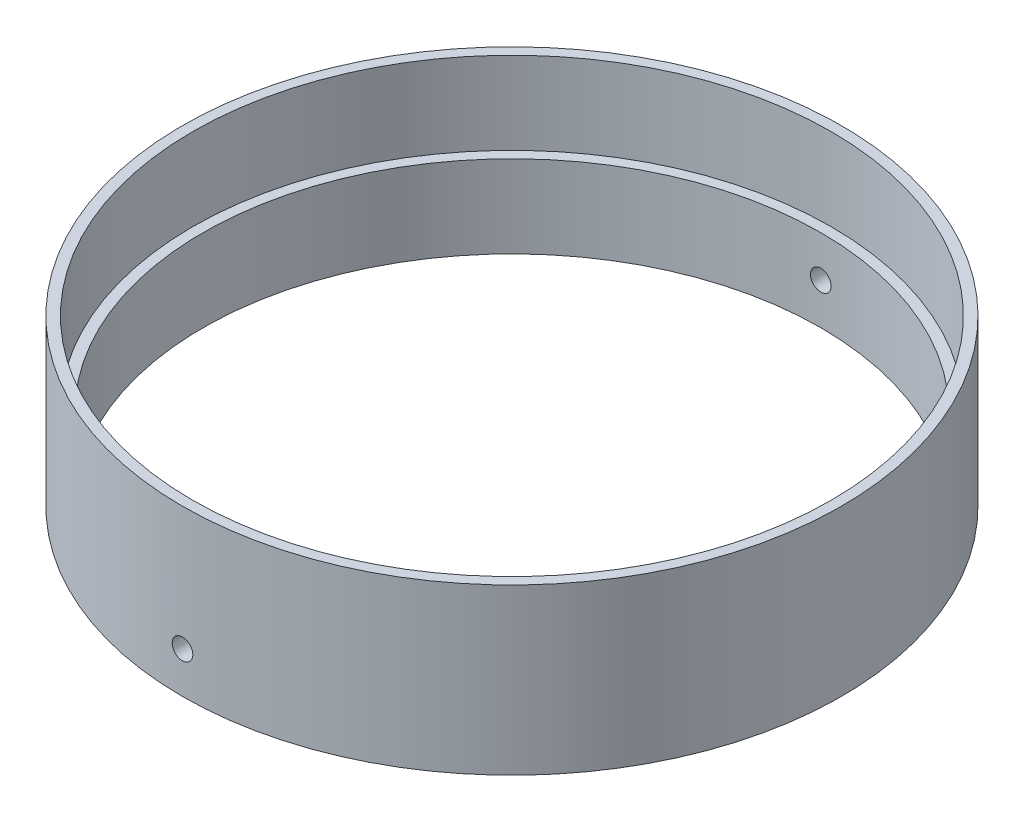
ISO-10303-21;
HEADER;
FILE_DESCRIPTION(('STEP AP214'),'2;1');
FILE_NAME('part.step','',(''),(''),'','','');
FILE_SCHEMA(('AUTOMOTIVE_DESIGN { 1 0 10303 214 1 1 1 1 }'));
ENDSEC;
DATA;
#1=APPLICATION_CONTEXT('core data for automotive mechanical design processes');
#2=APPLICATION_PROTOCOL_DEFINITION('international standard','automotive_design',2000,#1);
#3=PRODUCT_CONTEXT('',#1,'mechanical');
#4=PRODUCT('Part','Part','',(#3));
#5=PRODUCT_RELATED_PRODUCT_CATEGORY('part','',(#4));
#6=PRODUCT_DEFINITION_FORMATION('','',#4);
#7=PRODUCT_DEFINITION_CONTEXT('part definition',#1,'design');
#8=PRODUCT_DEFINITION('design','',#6,#7);
#9=PRODUCT_DEFINITION_SHAPE('','',#8);
#10=(LENGTH_UNIT() NAMED_UNIT(*) SI_UNIT(.MILLI.,.METRE.));
#11=(NAMED_UNIT(*) PLANE_ANGLE_UNIT() SI_UNIT($,.RADIAN.));
#12=(NAMED_UNIT(*) SI_UNIT($,.STERADIAN.) SOLID_ANGLE_UNIT());
#13=UNCERTAINTY_MEASURE_WITH_UNIT(LENGTH_MEASURE(1.E-05),#10,'distance_accuracy_value','');
#14=(GEOMETRIC_REPRESENTATION_CONTEXT(3) GLOBAL_UNCERTAINTY_ASSIGNED_CONTEXT((#13)) GLOBAL_UNIT_ASSIGNED_CONTEXT((#10,
#11,#12)) REPRESENTATION_CONTEXT('',''));
#15=CARTESIAN_POINT('',(0.,0.,0.));
#16=DIRECTION('',(0.,0.,1.));
#17=DIRECTION('',(1.,0.,0.));
#18=AXIS2_PLACEMENT_3D('',#15,#16,#17);
#19=CARTESIAN_POINT('',(0.,25.4,0.));
#20=DIRECTION('',(0.,-1.,0.));
#21=DIRECTION('',(0.,0.,-1.));
#22=AXIS2_PLACEMENT_3D('',#19,#20,#21);
#23=CYLINDRICAL_SURFACE('',#22,101.6);
#24=CARTESIAN_POINT('',(0.,0.,0.));
#25=DIRECTION('',(0.,1.,0.));
#26=DIRECTION('',(0.,0.,1.));
#27=AXIS2_PLACEMENT_3D('',#24,#25,#26);
#28=CIRCLE('',#27,101.6);
#29=CARTESIAN_POINT('',(0.,0.,101.6));
#30=VERTEX_POINT('',#29);
#31=EDGE_CURVE('E10',#30,#30,#28,.T.);
#32=ORIENTED_EDGE('',*,*,#31,.T.);
#33=EDGE_LOOP('',(#32));
#34=FACE_BOUND('',#33,.T.);
#35=CARTESIAN_POINT('',(3.17500000000001,12.7,101.550378507419));
#36=CARTESIAN_POINT('',(3.17499210766971,12.5217055785541,101.550379176816));
#37=CARTESIAN_POINT('',(3.15993120930314,12.3432829850299,101.550853105128));
#38=CARTESIAN_POINT('',(3.10006109050174,11.9913548542956,101.552698061822));
#39=CARTESIAN_POINT('',(3.0552163585708,11.8178554448388,101.554070161073));
#40=CARTESIAN_POINT('',(2.93705932198143,11.4809229604993,101.557555877879));
#41=CARTESIAN_POINT('',(2.86376097191941,11.3174849966031,101.559669131899));
#42=CARTESIAN_POINT('',(2.69079745129024,11.0052791134401,101.564398572411));
#43=CARTESIAN_POINT('',(2.59113870697352,10.8565076308328,101.567014636284));
#44=CARTESIAN_POINT('',(2.36822719597392,10.5777402532901,101.572456392397));
#45=CARTESIAN_POINT('',(2.244964778874,10.4477520762267,101.575282170088));
#46=CARTESIAN_POINT('',(1.97836196320222,10.210306208636,101.580824091225));
#47=CARTESIAN_POINT('',(1.83502076450043,10.1028494163999,101.583540230297));
#48=CARTESIAN_POINT('',(1.53229954286071,9.9135036831595,101.588557150066));
#49=CARTESIAN_POINT('',(1.37291654163202,9.83161950153873,101.590857853412));
#50=CARTESIAN_POINT('',(1.04265721945234,9.69577431340491,101.594783872108));
#51=CARTESIAN_POINT('',(0.871780946533434,9.64181319020543,101.59640919028));
#52=CARTESIAN_POINT('',(0.523445134952768,9.56336282641905,101.598800753743));
#53=CARTESIAN_POINT('',(0.345987781009485,9.53886389398056,101.599567281536));
#54=CARTESIAN_POINT('',(-0.0105223107606282,9.52000348492783,101.600155806165));
#55=CARTESIAN_POINT('',(-0.189575041923588,9.52564188248922,101.599977806946));
#56=CARTESIAN_POINT('',(-0.544127580151884,9.56688790623458,101.598697583569));
#57=CARTESIAN_POINT('',(-0.719628605552931,9.60248507094955,101.597595682035));
#58=CARTESIAN_POINT('',(-1.06216257870286,9.70262197053929,101.594592209576));
#59=CARTESIAN_POINT('',(-1.22919550702911,9.76716177179427,101.592690636816));
#60=CARTESIAN_POINT('',(-1.55008547292073,9.92336388852179,101.588301577628));
#61=CARTESIAN_POINT('',(-1.70394017611125,10.0150309965335,101.585813987684));
#62=CARTESIAN_POINT('',(-1.99408071057247,10.2228820687422,101.580533229413));
#63=CARTESIAN_POINT('',(-2.13036649767178,10.3390660945772,101.577740060317));
#64=CARTESIAN_POINT('',(-2.38156153576331,10.5927121756042,101.572161503668));
#65=CARTESIAN_POINT('',(-2.49646162071782,10.7301833085429,101.569376119953));
#66=CARTESIAN_POINT('',(-2.701553083232,11.022469280321,101.564128362123));
#67=CARTESIAN_POINT('',(-2.79174445663333,11.1772841220793,101.561665988062));
#68=CARTESIAN_POINT('',(-2.94485729333622,11.49986803747,101.55734198599));
#69=CARTESIAN_POINT('',(-3.00777845730184,11.6676372532745,101.555480364574));
#70=CARTESIAN_POINT('',(-3.10455885572515,12.0113651953678,101.552568054531));
#71=CARTESIAN_POINT('',(-3.1384181760676,12.1873238974531,101.551517363506));
#72=CARTESIAN_POINT('',(-3.17610249107874,12.5423562163494,101.550345820309));
#73=CARTESIAN_POINT('',(-3.17994018517136,12.7214284839627,101.550224574973));
#74=CARTESIAN_POINT('',(-3.15750540547295,13.077674742813,101.550924568588));
#75=CARTESIAN_POINT('',(-3.1312329696626,13.2548487364441,101.551745806351));
#76=CARTESIAN_POINT('',(-3.04933422993336,13.6022336539681,101.554237830514));
#77=CARTESIAN_POINT('',(-2.99371369909333,13.772445940209,101.55590844983));
#78=CARTESIAN_POINT('',(-2.85470349300521,14.1011175514295,101.559910767651));
#79=CARTESIAN_POINT('',(-2.77131375684341,14.2595768506273,101.562242467606));
#80=CARTESIAN_POINT('',(-2.57909955588367,14.5603028821413,101.567305056531));
#81=CARTESIAN_POINT('',(-2.47026653919634,14.7025641460813,101.570036079604));
#82=CARTESIAN_POINT('',(-2.23026770572112,14.9668008901224,101.57558897257));
#83=CARTESIAN_POINT('',(-2.09910182783791,15.0887763147265,101.57841084271));
#84=CARTESIAN_POINT('',(-1.81810620460368,15.3090213236597,101.583828466682));
#85=CARTESIAN_POINT('',(-1.66827003790316,15.4072827176108,101.586424142193));
#86=CARTESIAN_POINT('',(-1.35421990516617,15.5772543754745,101.5910956639));
#87=CARTESIAN_POINT('',(-1.19000597297368,15.6489647018839,101.593171511319));
#88=CARTESIAN_POINT('',(-0.851892603354025,15.7637842705174,101.596569002846));
#89=CARTESIAN_POINT('',(-0.67799496832831,15.8068988160377,101.597890786792));
#90=CARTESIAN_POINT('',(-0.325424983150856,15.8633203508634,101.599631708937));
#91=CARTESIAN_POINT('',(-0.146752638268152,15.876627373061,101.60005084813));
#92=CARTESIAN_POINT('',(0.210213052705784,15.8730555152026,101.599939242373));
#93=CARTESIAN_POINT('',(0.388506528154727,15.8561895357496,101.599408903376));
#94=CARTESIAN_POINT('',(0.739729933166017,15.7927769777905,101.597458893568));
#95=CARTESIAN_POINT('',(0.912659852129337,15.7462303406358,101.596039221001));
#96=CARTESIAN_POINT('',(1.24825200554197,15.6247796194457,101.592470444147));
#97=CARTESIAN_POINT('',(1.41091407130161,15.549875069662,101.59032132788));
#98=CARTESIAN_POINT('',(1.72135077854657,15.3738389807278,101.585535793298));
#99=CARTESIAN_POINT('',(1.86912595425651,15.27270838318,101.582899392479));
#100=CARTESIAN_POINT('',(2.14565396964068,15.0470519938117,101.577435176522));
#101=CARTESIAN_POINT('',(2.27440068960502,14.9225187046132,101.574607300229));
#102=CARTESIAN_POINT('',(2.50919536915219,14.6535690274683,101.569078815709));
#103=CARTESIAN_POINT('',(2.61523770200814,14.5091477253022,101.56637823916));
#104=CARTESIAN_POINT('',(2.80163299257844,14.2044623771402,101.561407924922));
#105=CARTESIAN_POINT('',(2.88196886745398,14.0441878883614,101.559138474135));
#106=CARTESIAN_POINT('',(3.01449800643724,13.7125425868637,101.555291536551));
#107=CARTESIAN_POINT('',(3.06672481471232,13.5411852748204,101.553713225397));
#108=CARTESIAN_POINT('',(3.12771946742776,13.2572886399953,101.551848253225));
#109=CARTESIAN_POINT('',(3.14542734209638,13.146591858221,101.551299494784));
#110=CARTESIAN_POINT('',(3.16907008534632,12.9239469093531,101.550564411692));
#111=CARTESIAN_POINT('',(3.1750049577046,12.8119987426609,101.550378086925));
#112=CARTESIAN_POINT('',(3.17500000000001,12.7,101.550378507419));
#113=B_SPLINE_CURVE_WITH_KNOTS('',3,(#35,#36,#37,#38,#39,#40,#41,#42,#43,#44,#45,#46,#47,#48,
#49,#50,#51,#52,#53,#54,#55,#56,#57,#58,#59,#60,#61,#62,#63,#64,#65,#66,#67,#68,#69,#70,#71,#72,
#73,#74,#75,#76,#77,#78,#79,#80,#81,#82,#83,#84,#85,#86,#87,#88,#89,#90,#91,#92,#93,#94,#95,#96,
#97,#98,#99,#100,#101,#102,#103,#104,#105,#106,#107,#108,#109,#110,#111,#112),.UNSPECIFIED.,.T.,
.F.,(4,2,2,2,2,2,2,2,2,2,2,2,2,2,2,2,2,2,2,2,2,2,2,2,2,2,2,2,2,2,2,2,2,2,2,2,2,2,4),(0.,
0.534474452858819,1.06958731053309,1.60443806203077,2.13915854529032,2.67409811886461,
3.20905901559513,3.74411941600589,4.27917758045838,4.81405968454553,5.34893955548372,
5.88363272619621,6.41832712323854,6.95311604036074,7.48790630201142,8.02292525272124,
8.55794429347205,9.0929692067986,9.62799253899194,10.1627895391522,10.6975858647247,
11.232277029435,11.7669693670361,12.3018416822413,12.8367154607038,13.3717737109285,
13.9068307017077,14.441788434497,14.976745576969,15.5114740507605,16.0462035811719,
16.5809418943236,17.115661011243,17.6505517258161,18.1855748469229,18.7209527747368,
19.2556903806156,19.5914299142661,19.9271693402062),.UNSPECIFIED.);
#114=CARTESIAN_POINT('',(3.17500000000001,12.7,101.550378507419));
#115=VERTEX_POINT('',#114);
#116=EDGE_CURVE('E78',#115,#115,#113,.T.);
#117=ORIENTED_EDGE('',*,*,#116,.T.);
#118=EDGE_LOOP('',(#117));
#119=FACE_BOUND('',#118,.T.);
#120=CARTESIAN_POINT('',(0.,15.875,-101.6));
#121=CARTESIAN_POINT('',(-0.17829444541826,15.8749921076915,-101.59999933185));
#122=CARTESIAN_POINT('',(-0.356717062832069,15.8599312054119,-101.599525641198));
#123=CARTESIAN_POINT('',(-0.708645243204515,15.8000610696542,-101.597681532956));
#124=CARTESIAN_POINT('',(-0.882144678428437,15.7552163247609,-101.596310044946));
#125=CARTESIAN_POINT('',(-1.21907721723227,15.6370592502445,-101.592825655141));
#126=CARTESIAN_POINT('',(-1.38251520960743,15.5637608745991,-101.590713116813));
#127=CARTESIAN_POINT('',(-1.69472114040193,15.3907972937405,-101.585984898559));
#128=CARTESIAN_POINT('',(-1.84349264219786,15.2911385148414,-101.583369341304));
#129=CARTESIAN_POINT('',(-2.12225999772232,15.0682269690547,-101.577928168904));
#130=CARTESIAN_POINT('',(-2.25224813974061,14.9449645594614,-101.575102468198));
#131=CARTESIAN_POINT('',(-2.48969393979339,14.678361773471,-101.56956023638));
#132=CARTESIAN_POINT('',(-2.59715069942927,14.5350205968488,-101.566843709625));
#133=CARTESIAN_POINT('',(-2.78649639885248,14.2322993942057,-101.561825719224));
#134=CARTESIAN_POINT('',(-2.86838057319272,14.0729163861004,-101.559524332973));
#135=CARTESIAN_POINT('',(-3.00422574596392,13.7426570489669,-101.555596953101));
#136=CARTESIAN_POINT('',(-3.05818686116998,13.5717807680072,-101.553970956656));
#137=CARTESIAN_POINT('',(-3.13663720784865,13.223444933222,-101.551578339131));
#138=CARTESIAN_POINT('',(-3.1611361306123,13.0459875639898,-101.550811435467));
#139=CARTESIAN_POINT('',(-3.17999651501943,12.6894774423889,-101.550222625962));
#140=CARTESIAN_POINT('',(-3.17435810258891,12.5104246966896,-101.550400716172));
#141=CARTESIAN_POINT('',(-3.13311205559772,12.1558722248293,-101.551681548413));
#142=CARTESIAN_POINT('',(-3.09751489746584,11.9803712785881,-101.55278396721));
#143=CARTESIAN_POINT('',(-2.99737803859707,11.6378374603685,-101.55578867349));
#144=CARTESIAN_POINT('',(-2.93283827133369,11.4708046078554,-101.557690962813));
#145=CARTESIAN_POINT('',(-2.77663622437451,11.1499147327147,-101.56208134154));
#146=CARTESIAN_POINT('',(-2.68496914410743,10.996060048374,-101.564569534614));
#147=CARTESIAN_POINT('',(-2.47711813078671,10.7059195397872,-101.569851120769));
#148=CARTESIAN_POINT('',(-2.36093413611307,10.5696337596995,-101.572644514617));
#149=CARTESIAN_POINT('',(-2.10728807682961,10.3184386853086,-101.578223045001));
#150=CARTESIAN_POINT('',(-1.96981692820448,10.2035385633656,-101.581008177491));
#151=CARTESIAN_POINT('',(-1.67753091199398,9.99844703374946,-101.58625506575));
#152=CARTESIAN_POINT('',(-1.5227160415415,9.90825563016097,-101.588716821464));
#153=CARTESIAN_POINT('',(-1.20013211915158,9.75514277187085,-101.593039490202));
#154=CARTESIAN_POINT('',(-1.03236292953287,9.69222160705017,-101.594900396837));
#155=CARTESIAN_POINT('',(-0.688635044239827,9.59544119885857,-101.597811495046));
#156=CARTESIAN_POINT('',(-0.512676372725552,9.56158186975711,-101.598861689011));
#157=CARTESIAN_POINT('',(-0.157644066811084,9.52389752183703,-101.600032674419));
#158=CARTESIAN_POINT('',(0.021428219278549,9.52005981194461,-101.600153858583));
#159=CARTESIAN_POINT('',(0.377674518904001,9.54249456664171,-101.599454204535));
#160=CARTESIAN_POINT('',(0.55484853483412,9.5687669932486,-101.598633367511));
#161=CARTESIAN_POINT('',(0.902233557022747,9.65066573677063,-101.596142430913));
#162=CARTESIAN_POINT('',(1.07244592343748,9.70628628988879,-101.594472498098));
#163=CARTESIAN_POINT('',(1.40111768511455,9.84529656746073,-101.590471538319));
#164=CARTESIAN_POINT('',(1.55957705464995,9.9286863526983,-101.588140509909));
#165=CARTESIAN_POINT('',(1.86030313217481,10.1209006247994,-101.583078956662));
#166=CARTESIAN_POINT('',(2.00256437977189,10.2297336510623,-101.580348297815));
#167=CARTESIAN_POINT('',(2.26680108636227,10.4697324945142,-101.574795664967));
#168=CARTESIAN_POINT('',(2.3887764897891,10.6008983728748,-101.571973690716));
#169=CARTESIAN_POINT('',(2.60902145568162,10.8818939864794,-101.566555435896));
#170=CARTESIAN_POINT('',(2.70728282777606,11.0317301430637,-101.563959233502));
#171=CARTESIAN_POINT('',(2.87725444723098,11.3457802499967,-101.559286465904));
#172=CARTESIAN_POINT('',(2.94896475708831,11.5099941665014,-101.557209899476));
#173=CARTESIAN_POINT('',(3.06378431415719,11.8481075482365,-101.553811092979));
#174=CARTESIAN_POINT('',(3.10689885751189,12.0220052134958,-101.552488713235));
#175=CARTESIAN_POINT('',(3.16332037775235,12.3745752622159,-101.550746984259));
#176=CARTESIAN_POINT('',(3.17662738768997,12.553247640382,-101.550327634026));
#177=CARTESIAN_POINT('',(3.17305549523723,12.9102133081107,-101.550439295317));
#178=CARTESIAN_POINT('',(3.15618950800205,13.0885067271783,-101.550969900225));
#179=CARTESIAN_POINT('',(3.0927769543687,13.4397300175548,-101.552920801539));
#180=CARTESIAN_POINT('',(3.04623032922044,13.6126598782463,-101.554341099706));
#181=CARTESIAN_POINT('',(2.92477965272701,13.9482519190055,-101.557911213626));
#182=CARTESIAN_POINT('',(2.84987513556246,14.1109139303578,-101.560061041361));
#183=CARTESIAN_POINT('',(2.67383912861159,14.4213505424842,-101.564847772856));
#184=CARTESIAN_POINT('',(2.57270858036943,14.5691256774497,-101.567484659129));
#185=CARTESIAN_POINT('',(2.34705224393445,14.8456536983071,-101.572949409054));
#186=CARTESIAN_POINT('',(2.22251894718246,14.9744004553672,-101.575777333813));
#187=CARTESIAN_POINT('',(1.95356923985108,15.209195206216,-101.58130545543));
#188=CARTESIAN_POINT('',(1.80914791513171,15.315237573373,-101.584005620498));
#189=CARTESIAN_POINT('',(1.50446254992881,15.501632899391,-101.588974831323));
#190=CARTESIAN_POINT('',(1.34418807066746,15.5819687819703,-101.591243590103));
#191=CARTESIAN_POINT('',(1.01254278960436,15.7144979380233,-101.5950891686));
#192=CARTESIAN_POINT('',(0.841185488426407,15.7667247555404,-101.596666812641));
#193=CARTESIAN_POINT('',(0.557288828735596,15.8277194352316,-101.598530954724));
#194=CARTESIAN_POINT('',(0.446592009326103,15.8454273220097,-101.599079454936));
#195=CARTESIAN_POINT('',(0.223946984996098,15.8690700813545,-101.599814187371));
#196=CARTESIAN_POINT('',(0.111998780476408,15.8750049576919,-101.60000041971));
#197=CARTESIAN_POINT('',(0.,15.875,-101.6));
#198=B_SPLINE_CURVE_WITH_KNOTS('',3,(#120,#121,#122,#123,#124,#125,#126,#127,#128,#129,#130,
#131,#132,#133,#134,#135,#136,#137,#138,#139,#140,#141,#142,#143,#144,#145,#146,#147,#148,#149,
#150,#151,#152,#153,#154,#155,#156,#157,#158,#159,#160,#161,#162,#163,#164,#165,#166,#167,#168,
#169,#170,#171,#172,#173,#174,#175,#176,#177,#178,#179,#180,#181,#182,#183,#184,#185,#186,#187,
#188,#189,#190,#191,#192,#193,#194,#195,#196,#197),.UNSPECIFIED.,.T.,.F.,(4,2,2,2,2,2,2,2,2,2,2,
2,2,2,2,2,2,2,2,2,2,2,2,2,2,2,2,2,2,2,2,2,2,2,2,2,2,2,4),(0.,0.534474524850322,1.06958745295146,
1.60443828656723,2.13915885068054,2.67409833008819,3.20905913519732,3.7441195707623,
4.27917776866964,4.81405991639625,5.34893982917028,5.88363277470169,6.41832694926646,
6.95311580235717,7.48790599958439,8.02292504369507,8.55794417625007,9.092968995886,
9.6279922372279,10.1627892953479,10.6975856788453,11.2322770705948,11.7669696327323,
12.3018419095919,12.8367156515361,13.3717738650713,13.906830819159,14.4417886491295,
14.9767458859156,15.511474196066,16.0462035646649,16.5809417173478,17.1156606749834,
17.6505514861495,18.1855747016207,18.7209525875885,19.2556901540086,19.5914298009249,
19.9271693403061),.UNSPECIFIED.);
#199=CARTESIAN_POINT('',(0.,15.875,-101.6));
#200=VERTEX_POINT('',#199);
#201=EDGE_CURVE('E84',#200,#200,#198,.T.);
#202=ORIENTED_EDGE('',*,*,#201,.T.);
#203=EDGE_LOOP('',(#202));
#204=FACE_BOUND('',#203,.T.);
#205=CARTESIAN_POINT('',(0.,50.8,0.));
#206=DIRECTION('',(0.,1.,0.));
#207=DIRECTION('',(0.,0.,1.));
#208=AXIS2_PLACEMENT_3D('',#205,#206,#207);
#209=CIRCLE('',#208,101.6);
#210=CARTESIAN_POINT('',(0.,50.8,101.6));
#211=VERTEX_POINT('',#210);
#212=EDGE_CURVE('E119',#211,#211,#209,.T.);
#213=ORIENTED_EDGE('',*,*,#212,.F.);
#214=EDGE_LOOP('',(#213));
#215=FACE_BOUND('',#214,.T.);
#216=ADVANCED_FACE('F32',(#34,#119,#204,#215),#23,.T.);
#217=CARTESIAN_POINT('',(0.,171.45,0.));
#218=DIRECTION('',(0.,-1.,0.));
#219=DIRECTION('',(0.,0.,-1.));
#220=AXIS2_PLACEMENT_3D('',#217,#218,#219);
#221=CYLINDRICAL_SURFACE('',#220,98.425);
#222=CARTESIAN_POINT('',(0.,25.4,0.));
#223=DIRECTION('',(0.,1.,0.));
#224=DIRECTION('',(0.,0.,1.));
#225=AXIS2_PLACEMENT_3D('',#222,#223,#224);
#226=CIRCLE('',#225,98.425);
#227=CARTESIAN_POINT('',(0.,25.4,98.425));
#228=VERTEX_POINT('',#227);
#229=EDGE_CURVE('E57',#228,#228,#226,.T.);
#230=ORIENTED_EDGE('',*,*,#229,.F.);
#231=EDGE_LOOP('',(#230));
#232=FACE_BOUND('',#231,.T.);
#233=CARTESIAN_POINT('',(0.,50.8,0.));
#234=DIRECTION('',(0.,1.,0.));
#235=DIRECTION('',(0.,0.,1.));
#236=AXIS2_PLACEMENT_3D('',#233,#234,#235);
#237=CIRCLE('',#236,98.425);
#238=CARTESIAN_POINT('',(0.,50.8,98.425));
#239=VERTEX_POINT('',#238);
#240=EDGE_CURVE('E36',#239,#239,#237,.T.);
#241=ORIENTED_EDGE('',*,*,#240,.T.);
#242=EDGE_LOOP('',(#241));
#243=FACE_BOUND('',#242,.T.);
#244=ADVANCED_FACE('F71',(#232,#243),#221,.F.);
#245=CARTESIAN_POINT('',(0.,25.4,0.));
#246=DIRECTION('',(0.,1.,0.));
#247=DIRECTION('',(0.,0.,1.));
#248=AXIS2_PLACEMENT_3D('',#245,#246,#247);
#249=PLANE('',#248);
#250=CARTESIAN_POINT('',(0.,25.4,0.));
#251=DIRECTION('',(0.,1.,0.));
#252=DIRECTION('',(0.,0.,1.));
#253=AXIS2_PLACEMENT_3D('',#250,#251,#252);
#254=CIRCLE('',#253,95.25);
#255=CARTESIAN_POINT('',(0.,25.4,95.25));
#256=VERTEX_POINT('',#255);
#257=EDGE_CURVE('E40',#256,#256,#254,.T.);
#258=ORIENTED_EDGE('',*,*,#257,.F.);
#259=EDGE_LOOP('',(#258));
#260=FACE_BOUND('',#259,.T.);
#261=ORIENTED_EDGE('',*,*,#229,.T.);
#262=EDGE_LOOP('',(#261));
#263=FACE_BOUND('',#262,.T.);
#264=ADVANCED_FACE('F104',(#260,#263),#249,.T.);
#265=CARTESIAN_POINT('',(0.,0.,0.));
#266=DIRECTION('',(0.,1.,0.));
#267=DIRECTION('',(0.,0.,1.));
#268=AXIS2_PLACEMENT_3D('',#265,#266,#267);
#269=PLANE('',#268);
#270=ORIENTED_EDGE('',*,*,#31,.F.);
#271=EDGE_LOOP('',(#270));
#272=FACE_BOUND('',#271,.T.);
#273=CARTESIAN_POINT('',(0.,0.,0.));
#274=DIRECTION('',(0.,1.,0.));
#275=DIRECTION('',(0.,0.,1.));
#276=AXIS2_PLACEMENT_3D('',#273,#274,#275);
#277=CIRCLE('',#276,95.25);
#278=CARTESIAN_POINT('',(0.,0.,95.25));
#279=VERTEX_POINT('',#278);
#280=EDGE_CURVE('E45',#279,#279,#277,.T.);
#281=ORIENTED_EDGE('',*,*,#280,.T.);
#282=EDGE_LOOP('',(#281));
#283=FACE_BOUND('',#282,.T.);
#284=ADVANCED_FACE('F95',(#272,#283),#269,.F.);
#285=CARTESIAN_POINT('',(0.,25.4,0.));
#286=DIRECTION('',(0.,-1.,0.));
#287=DIRECTION('',(0.,0.,-1.));
#288=AXIS2_PLACEMENT_3D('',#285,#286,#287);
#289=CYLINDRICAL_SURFACE('',#288,95.25);
#290=CARTESIAN_POINT('',(0.,15.875,-95.25));
#291=CARTESIAN_POINT('',(-0.178288014205469,15.8749921099797,-95.2499992877185));
#292=CARTESIAN_POINT('',(-0.35670404301082,15.8599322899088,-95.2494940545202));
#293=CARTESIAN_POINT('',(-0.708618786642761,15.8000667033327,-95.247527149192));
#294=CARTESIAN_POINT('',(-0.882111380752901,15.7552254689538,-95.2460643366724));
#295=CARTESIAN_POINT('',(-1.21903020311678,15.6370782671911,-95.2423479199465));
#296=CARTESIAN_POINT('',(-1.38246133720674,15.5637863014259,-95.2400947047781));
#297=CARTESIAN_POINT('',(-1.69465490984138,15.3908384024968,-95.2350515888675));
#298=CARTESIAN_POINT('',(-1.84342090154813,15.291188877064,-95.2322618186111));
#299=CARTESIAN_POINT('',(-2.12218556370051,15.0682934918603,-95.2264580274455));
#300=CARTESIAN_POINT('',(-2.25217573326696,14.9450370022557,-95.2234439058897));
#301=CARTESIAN_POINT('',(-2.48962706713187,14.6784457078102,-95.2175320059258));
#302=CARTESIAN_POINT('',(-2.59708733118796,14.5351101010364,-95.2146342321705));
#303=CARTESIAN_POINT('',(-2.78644430978814,14.2323944753431,-95.209281248753));
#304=CARTESIAN_POINT('',(-2.86833553510842,14.0730110209316,-95.2068261341696));
#305=CARTESIAN_POINT('',(-3.00419427179459,13.7427484180518,-95.2026363242482));
#306=CARTESIAN_POINT('',(-3.0581619083124,13.5718693211102,-95.2009016256814));
#307=CARTESIAN_POINT('',(-3.13662219411182,13.2235338209386,-95.1983490291259));
#308=CARTESIAN_POINT('',(-3.16112587672659,13.0460799054496,-95.1975307879603));
#309=CARTESIAN_POINT('',(-3.17999668570917,12.6895756444367,-95.1969023362763));
#310=CARTESIAN_POINT('',(-3.17436394787339,12.51052530611,-95.1970921212156));
#311=CARTESIAN_POINT('',(-3.13313110293596,12.1559856422188,-95.1984580006067));
#312=CARTESIAN_POINT('',(-3.09754291873007,11.9804949283048,-95.199633702642));
#313=CARTESIAN_POINT('',(-2.9974278483576,11.637980065318,-95.2028382650113));
#314=CARTESIAN_POINT('',(-2.93290089073128,11.4709559371533,-95.204867127452));
#315=CARTESIAN_POINT('',(-2.77672628211837,11.150077069811,-95.2095497572341));
#316=CARTESIAN_POINT('',(-2.68507316991503,10.9962249905667,-95.2122036503888));
#317=CARTESIAN_POINT('',(-2.47725199093246,10.7060866864832,-95.2178370442585));
#318=CARTESIAN_POINT('',(-2.36108385268965,10.5698005128521,-95.2208165459226));
#319=CARTESIAN_POINT('',(-2.10746278816201,10.3185932403717,-95.226767032564));
#320=CARTESIAN_POINT('',(-1.96999952578007,10.2036825765621,-95.2297380126881));
#321=CARTESIAN_POINT('',(-1.67772673885139,9.99856857433819,-95.2353351453954));
#322=CARTESIAN_POINT('',(-1.52291721133625,9.90836524015203,-95.2379612979196));
#323=CARTESIAN_POINT('',(-1.20034054125892,9.75522759046648,-95.2425727920819));
#324=CARTESIAN_POINT('',(-1.03257324053303,9.69229360788117,-95.2445581258967));
#325=CARTESIAN_POINT('',(-0.688845962036509,9.59548781544584,-95.2476640668552));
#326=CARTESIAN_POINT('',(-0.51288601171619,9.56161590822778,-95.2487846768962));
#327=CARTESIAN_POINT('',(-0.157858971477509,9.52390856526775,-95.2500344826524));
#328=CARTESIAN_POINT('',(0.0212065833781273,9.52005869148349,-95.2501641549239));
#329=CARTESIAN_POINT('',(0.377441434269175,9.54246706730447,-95.2494187311239));
#330=CARTESIAN_POINT('',(0.554610733038178,9.5687252735008,-95.2485436365011));
#331=CARTESIAN_POINT('',(0.901983588498428,9.65059248390009,-95.2458876022523));
#332=CARTESIAN_POINT('',(1.07218869299429,9.70619492769273,-95.2441068651017));
#333=CARTESIAN_POINT('',(1.40084919010713,9.84516560412781,-95.2398401846069));
#334=CARTESIAN_POINT('',(1.55930455327258,9.9285339063644,-95.2373542394953));
#335=CARTESIAN_POINT('',(1.86003402528937,10.120706924152,-95.2319559490892));
#336=CARTESIAN_POINT('',(2.00230192504204,10.2295213516202,-95.2290434411493));
#337=CARTESIAN_POINT('',(2.26655563159649,10.4694835238204,-95.2231207764906));
#338=CARTESIAN_POINT('',(2.38854137629047,10.6006313369389,-95.2201106194728));
#339=CARTESIAN_POINT('',(2.60881630491986,10.881599372914,-95.2143306358773));
#340=CARTESIAN_POINT('',(2.70709616952693,11.0314269042029,-95.2115609040893));
#341=CARTESIAN_POINT('',(2.87710582468477,11.3454640855491,-95.2065755433744));
#342=CARTESIAN_POINT('',(2.94883568245094,11.5096736991947,-95.2043599130447));
#343=CARTESIAN_POINT('',(3.06369285346345,11.8477787233272,-95.2007332451873));
#344=CARTESIAN_POINT('',(3.10682618491265,12.0216720874915,-95.1993220383757));
#345=CARTESIAN_POINT('',(3.16328562717376,12.3742373469042,-95.1974628554717));
#346=CARTESIAN_POINT('',(3.17661178302344,12.5529092349321,-95.1970148779239));
#347=CARTESIAN_POINT('',(3.17307791083633,12.9098665493694,-95.1971327232894));
#348=CARTESIAN_POINT('',(3.15623257164377,13.0881521215493,-95.1976980528791));
#349=CARTESIAN_POINT('',(3.09286412493688,13.4393630565238,-95.1997777458267));
#350=CARTESIAN_POINT('',(3.04634095883537,13.6122884087362,-95.2012921110582));
#351=CARTESIAN_POINT('',(2.92493975943028,13.9478751461103,-95.2050990804743));
#352=CARTESIAN_POINT('',(2.85006127523146,14.1105363680078,-95.2073916970344));
#353=CARTESIAN_POINT('',(2.67407928688088,14.4209762138111,-95.2124966316436));
#354=CARTESIAN_POINT('',(2.57297671207635,14.5687553648602,-95.2153089312747));
#355=CARTESIAN_POINT('',(2.34737045649868,14.8453053903538,-95.2211376426815));
#356=CARTESIAN_POINT('',(2.22285789635823,14.9740690190462,-95.224154131627));
#357=CARTESIAN_POINT('',(1.95394658349019,15.2089012230231,-95.2300511365124));
#358=CARTESIAN_POINT('',(1.80954291858429,15.3149641757215,-95.2329316186283));
#359=CARTESIAN_POINT('',(1.50488456553218,15.5014064252614,-95.2382330505752));
#360=CARTESIAN_POINT('',(1.34461902947333,15.5817679837848,-95.2406536825659));
#361=CARTESIAN_POINT('',(1.01298586132564,15.7143493239427,-95.2447570434446));
#362=CARTESIAN_POINT('',(0.841631725780528,15.7666026218868,-95.2464406507131));
#363=CARTESIAN_POINT('',(0.557664570446389,15.8276551852707,-95.2484308995264));
#364=CARTESIAN_POINT('',(0.446894237048621,15.8453871080913,-95.2490167547857));
#365=CARTESIAN_POINT('',(0.224099464227476,15.8690619932039,-95.2498015288282));
#366=CARTESIAN_POINT('',(0.112075025262759,15.8750049598075,-95.2500004477529));
#367=CARTESIAN_POINT('',(0.,15.875,-95.25));
#368=B_SPLINE_CURVE_WITH_KNOTS('',3,(#290,#291,#292,#293,#294,#295,#296,#297,#298,#299,#300,
#301,#302,#303,#304,#305,#306,#307,#308,#309,#310,#311,#312,#313,#314,#315,#316,#317,#318,#319,
#320,#321,#322,#323,#324,#325,#326,#327,#328,#329,#330,#331,#332,#333,#334,#335,#336,#337,#338,
#339,#340,#341,#342,#343,#344,#345,#346,#347,#348,#349,#350,#351,#352,#353,#354,#355,#356,#357,
#358,#359,#360,#361,#362,#363,#364,#365,#366,#367),.UNSPECIFIED.,.T.,.F.,(4,2,2,2,2,2,2,2,2,2,2,
2,2,2,2,2,2,2,2,2,2,2,2,2,2,2,2,2,2,2,2,2,2,2,2,2,2,2,4),(0.,0.534454950651534,1.06954754911538,
1.60437714262503,2.13907683414939,2.67401786075563,3.2089802582832,3.74405742400695,
4.2791321915249,4.8140065277433,5.34887845378967,5.88353759020736,6.4181980468891,
6.95296621825509,7.48773594854144,8.02276606007798,8.55779626317191,9.09283299792354,
9.62786794010914,10.1626455601577,10.6974224091813,11.232079750235,11.7667384313987,
12.301601507538,12.8364662214993,13.3715408616682,13.9066141472045,14.4415747895969,
14.9765346236793,15.5112340859813,16.0459346038404,16.5806436246561,17.1153336986766,
17.6502269903718,18.1852526134608,18.7206467020207,19.2554009631416,19.5913689992933,
19.9273369125768),.UNSPECIFIED.);
#369=CARTESIAN_POINT('',(0.,15.875,-95.25));
#370=VERTEX_POINT('',#369);
#371=EDGE_CURVE('E56',#370,#370,#368,.T.);
#372=ORIENTED_EDGE('',*,*,#371,.F.);
#373=EDGE_LOOP('',(#372));
#374=FACE_BOUND('',#373,.T.);
#375=CARTESIAN_POINT('',(3.17500000000001,12.7,95.1970686260874));
#376=CARTESIAN_POINT('',(3.17499210995144,12.5217120168263,95.1970693398758));
#377=CARTESIAN_POINT('',(3.15993229494564,12.3432960189457,95.1975748614451));
#378=CARTESIAN_POINT('',(3.10006673031846,11.9913813395699,95.1995427964216));
#379=CARTESIAN_POINT('',(3.05522551271869,11.8178887788153,95.2010063507621));
#380=CARTESIAN_POINT('',(2.93707836004997,11.4809700269557,95.2047243778985));
#381=CARTESIAN_POINT('',(2.86378642740061,11.3175389297318,95.2069784615718));
#382=CARTESIAN_POINT('',(2.69083860643459,11.0053454187581,95.212023060743));
#383=CARTESIAN_POINT('',(2.59118912576654,10.856579451893,95.2148134458183));
#384=CARTESIAN_POINT('',(2.36829378559556,10.5778147612429,95.2206179455612));
#385=CARTESIAN_POINT('',(2.24503728627652,10.4478245463124,95.2236321607338));
#386=CARTESIAN_POINT('',(1.9784459534146,10.2103731250214,95.2295436840187));
#387=CARTESIAN_POINT('',(1.83511031806176,10.1029128187643,95.2324409874565));
#388=CARTESIAN_POINT('',(1.53239466777308,9.91355579638225,95.2377926716549));
#389=CARTESIAN_POINT('',(1.3730112222554,9.83166456163337,95.2402469573961));
#390=CARTESIAN_POINT('',(1.04274863871628,9.69580580505528,95.2444351152067));
#391=CARTESIAN_POINT('',(0.871869552174265,9.64183815818896,95.246168990502));
#392=CARTESIAN_POINT('',(0.523534082040767,9.56337785024944,95.2487203076476));
#393=CARTESIAN_POINT('',(0.346080186352876,9.53887415511459,95.24953809256));
#394=CARTESIAN_POINT('',(-0.0104240360233955,9.52000331423299,95.250166198415));
#395=CARTESIAN_POINT('',(-0.189474355521546,9.5256360328214,95.2499765238928));
#396=CARTESIAN_POINT('',(-0.544014105307323,9.56686884766236,95.2486113834076));
#397=CARTESIAN_POINT('',(-0.719504921686115,9.60245704038402,95.2474363090177));
#398=CARTESIAN_POINT('',(-1.06201998521786,9.70257216345284,95.244233243774));
#399=CARTESIAN_POINT('',(-1.22904421151818,9.76709916507045,95.2422052508197));
#400=CARTESIAN_POINT('',(-1.54992319635463,9.92327386398821,95.2375242223168));
#401=CARTESIAN_POINT('',(-1.70377530001927,10.0149270121121,95.2348710611665));
#402=CARTESIAN_POINT('',(-1.99391363763476,10.2227482673427,95.2292386722337));
#403=CARTESIAN_POINT('',(-2.13019982036083,10.3389164459363,95.2262594435004));
#404=CARTESIAN_POINT('',(-2.38140704585944,10.5925375386266,95.2203089254937));
#405=CARTESIAN_POINT('',(-2.49631766177875,10.7300007807014,95.2173376407882));
#406=CARTESIAN_POINT('',(-2.7014315771212,11.0222735101047,95.2117394532357));
#407=CARTESIAN_POINT('',(-2.79163487222074,11.1770830004686,95.209112550449));
#408=CARTESIAN_POINT('',(-2.94477249395262,11.4996596614685,95.2044994381115));
#409=CARTESIAN_POINT('',(-3.00770647543103,11.6674269960833,95.2025132366704));
#410=CARTESIAN_POINT('',(-3.10451225522459,12.0111543480913,95.1994058246518));
#411=CARTESIAN_POINT('',(-3.13838415110748,12.1871143379781,95.1982846111705));
#412=CARTESIAN_POINT('',(-3.17609145147653,12.5421413950427,95.1970341281744));
#413=CARTESIAN_POINT('',(-3.17994130480866,12.7212069260092,95.1969043814923));
#414=CARTESIAN_POINT('',(-3.1575328966147,13.0774417241744,95.1976502170985));
#415=CARTESIAN_POINT('',(-3.13127467849502,13.2546109941065,95.1985257979374));
#416=CARTESIAN_POINT('',(-3.04940747297842,13.6019837141001,95.2011831518149));
#417=CARTESIAN_POINT('',(-2.99380505801161,13.7721887148043,95.2029647219295));
#418=CARTESIAN_POINT('',(-2.8548344740868,14.1008490171312,95.207233050313));
#419=CARTESIAN_POINT('',(-2.77146623536649,14.2593042892312,95.2097198103538));
#420=CARTESIAN_POINT('',(-2.57929330967501,14.5600337016402,95.215119357927));
#421=CARTESIAN_POINT('',(-2.47047889462172,14.7023016225197,95.2180323082322));
#422=CARTESIAN_POINT('',(-2.23051673538544,14.9665553775043,95.2239552893365));
#423=CARTESIAN_POINT('',(-2.09936892291453,15.0885411495913,95.2269653204324));
#424=CARTESIAN_POINT('',(-1.81840087449024,15.3088161339451,95.2327445391283));
#425=CARTESIAN_POINT('',(-1.66857333008612,15.4070960268672,95.235513631737));
#426=CARTESIAN_POINT('',(-1.35453611528646,15.5771057317819,95.2404974806661));
#427=CARTESIAN_POINT('',(-1.19032648130268,15.6488356109897,95.2427122383898));
#428=CARTESIAN_POINT('',(-0.852221472829107,15.7636927969699,95.2463373100456));
#429=CARTESIAN_POINT('',(-0.678328147811906,15.8068261312118,95.2477477934908));
#430=CARTESIAN_POINT('',(-0.325762970679945,15.8632855923355,95.2496059966001));
#431=CARTESIAN_POINT('',(-0.147091125752633,15.8766117640482,95.2500537177122));
#432=CARTESIAN_POINT('',(0.209866218718361,15.8730779366449,95.2499359392276));
#433=CARTESIAN_POINT('',(0.388151863843207,15.8562326075397,95.2493709320403));
#434=CARTESIAN_POINT('',(0.739362947136243,15.7928641552751,95.2472923205018));
#435=CARTESIAN_POINT('',(0.912288374745804,15.7463409736599,95.2457787142822));
#436=CARTESIAN_POINT('',(1.24787525796096,15.6249397164391,95.2419733672643));
#437=CARTESIAN_POINT('',(1.41053655033148,15.5500611900186,95.2396816140944));
#438=CARTESIAN_POINT('',(1.72097651935447,15.3740790955328,95.2345781322275));
#439=CARTESIAN_POINT('',(1.86875572319348,15.2729764568905,95.2317664219595));
#440=CARTESIAN_POINT('',(2.14530574166044,15.0473701327525,95.2259383594105));
#441=CARTESIAN_POINT('',(2.27406932234428,14.9228575823679,95.2229219298836));
#442=CARTESIAN_POINT('',(2.50890143403459,14.6539463085309,95.2170244856923));
#443=CARTESIAN_POINT('',(2.61496434233182,14.5095426727968,95.2141435047147));
#444=CARTESIAN_POINT('',(2.8014065459577,14.2048843418126,95.2088407341766));
#445=CARTESIAN_POINT('',(2.88176809448842,14.0446187934682,95.2064192623746));
#446=CARTESIAN_POINT('',(3.01434941252221,13.7129855989455,95.2023142518852));
#447=CARTESIAN_POINT('',(3.06660269849538,13.5416314493778,95.2006298347786));
#448=CARTESIAN_POINT('',(3.12765522695553,13.2576643262499,95.1986385777932));
#449=CARTESIAN_POINT('',(3.14538713409757,13.1468940415462,95.1980524087496));
#450=CARTESIAN_POINT('',(3.1690619983721,12.9240993663599,95.1972672086176));
#451=CARTESIAN_POINT('',(3.17500495982395,12.8120749763368,95.1970681773874));
#452=CARTESIAN_POINT('',(3.17500000000001,12.7,95.1970686260874));
#453=B_SPLINE_CURVE_WITH_KNOTS('',3,(#375,#376,#377,#378,#379,#380,#381,#382,#383,#384,#385,
#386,#387,#388,#389,#390,#391,#392,#393,#394,#395,#396,#397,#398,#399,#400,#401,#402,#403,#404,
#405,#406,#407,#408,#409,#410,#411,#412,#413,#414,#415,#416,#417,#418,#419,#420,#421,#422,#423,
#424,#425,#426,#427,#428,#429,#430,#431,#432,#433,#434,#435,#436,#437,#438,#439,#440,#441,#442,
#443,#444,#445,#446,#447,#448,#449,#450,#451,#452),.UNSPECIFIED.,.T.,.F.,(4,2,2,2,2,2,2,2,2,2,2,
2,2,2,2,2,2,2,2,2,2,2,2,2,2,2,2,2,2,2,2,2,2,2,2,2,2,2,4),(0.,0.534454857459336,1.06954736475695,
1.60437685196648,2.13907643882718,2.67401758733229,3.20898010346371,3.74405722370192,
4.27913194793422,4.81400622763058,5.34887809949001,5.88353752738356,6.41819827204276,
6.95296652634883,7.48773634008106,8.0227663306735,8.55779641489198,9.09283327091044,
9.62786833068681,10.1626458757874,10.6974226499074,11.232079697042,11.7667380875256,
12.3016012132233,12.8364659743795,13.371540662139,13.9066139952659,14.4415745118107,
14.9765342237581,15.5112338977829,16.0459346249994,16.5806438536555,17.1153341339804,
17.6502273006652,18.1852528016296,18.7206469442429,19.2554012563282,19.5913691459367,
19.9273369124489),.UNSPECIFIED.);
#454=CARTESIAN_POINT('',(3.17500000000001,12.7,95.1970686260874));
#455=VERTEX_POINT('',#454);
#456=EDGE_CURVE('E49',#455,#455,#453,.T.);
#457=ORIENTED_EDGE('',*,*,#456,.F.);
#458=EDGE_LOOP('',(#457));
#459=FACE_BOUND('',#458,.T.);
#460=ORIENTED_EDGE('',*,*,#257,.T.);
#461=EDGE_LOOP('',(#460));
#462=FACE_BOUND('',#461,.T.);
#463=ORIENTED_EDGE('',*,*,#280,.F.);
#464=EDGE_LOOP('',(#463));
#465=FACE_BOUND('',#464,.T.);
#466=ADVANCED_FACE('F61',(#374,#459,#462,#465),#289,.F.);
#467=CARTESIAN_POINT('',(0.,12.7,-101.6));
#468=DIRECTION('',(0.,0.,1.));
#469=DIRECTION('',(1.,0.,0.));
#470=AXIS2_PLACEMENT_3D('',#467,#468,#469);
#471=CYLINDRICAL_SURFACE('',#470,3.175);
#472=ORIENTED_EDGE('',*,*,#456,.T.);
#473=EDGE_LOOP('',(#472));
#474=FACE_BOUND('',#473,.T.);
#475=ORIENTED_EDGE('',*,*,#116,.F.);
#476=EDGE_LOOP('',(#475));
#477=FACE_BOUND('',#476,.T.);
#478=ADVANCED_FACE('F69',(#474,#477),#471,.F.);
#479=ORIENTED_EDGE('',*,*,#371,.T.);
#480=EDGE_LOOP('',(#479));
#481=FACE_BOUND('',#480,.T.);
#482=ORIENTED_EDGE('',*,*,#201,.F.);
#483=EDGE_LOOP('',(#482));
#484=FACE_BOUND('',#483,.T.);
#485=ADVANCED_FACE('F64',(#481,#484),#471,.F.);
#486=CARTESIAN_POINT('',(0.,50.8,0.));
#487=DIRECTION('',(0.,1.,0.));
#488=DIRECTION('',(0.,0.,1.));
#489=AXIS2_PLACEMENT_3D('',#486,#487,#488);
#490=PLANE('',#489);
#491=ORIENTED_EDGE('',*,*,#240,.F.);
#492=EDGE_LOOP('',(#491));
#493=FACE_BOUND('',#492,.T.);
#494=ORIENTED_EDGE('',*,*,#212,.T.);
#495=EDGE_LOOP('',(#494));
#496=FACE_BOUND('',#495,.T.);
#497=ADVANCED_FACE('F68',(#493,#496),#490,.T.);
#498=CLOSED_SHELL('',(#216,#244,#264,#284,#466,#478,#485,#497));
#499=MANIFOLD_SOLID_BREP('B2',#498);
#500=ADVANCED_BREP_SHAPE_REPRESENTATION('',(#18,#499),#14);
#501=SHAPE_DEFINITION_REPRESENTATION(#9,#500);
ENDSEC;
END-ISO-10303-21;
